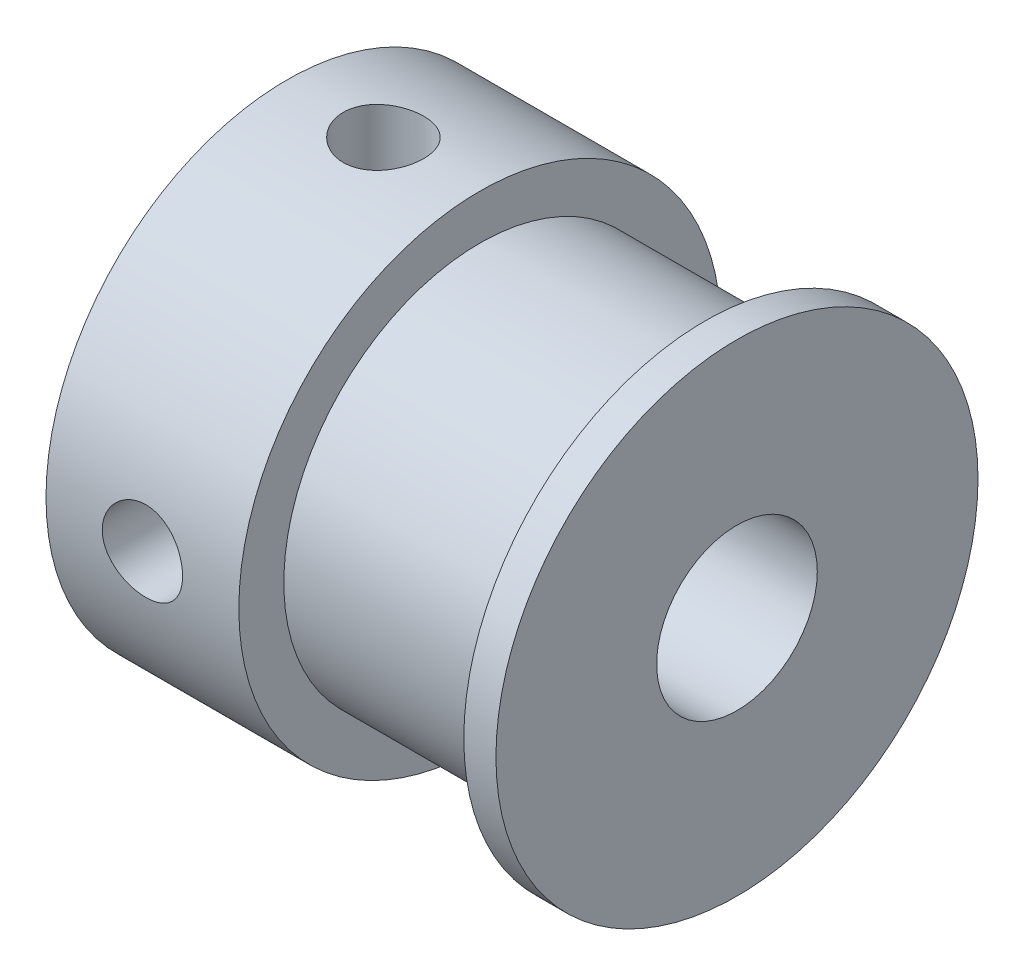
ISO-10303-21;
HEADER;
FILE_DESCRIPTION(('STEP AP214'),'2;1');
FILE_NAME('part.step','',(''),(''),'','','');
FILE_SCHEMA(('AUTOMOTIVE_DESIGN { 1 0 10303 214 1 1 1 1 }'));
ENDSEC;
DATA;
#1=APPLICATION_CONTEXT('core data for automotive mechanical design processes');
#2=APPLICATION_PROTOCOL_DEFINITION('international standard','automotive_design',2000,#1);
#3=PRODUCT_CONTEXT('',#1,'mechanical');
#4=PRODUCT('Part','Part','',(#3));
#5=PRODUCT_RELATED_PRODUCT_CATEGORY('part','',(#4));
#6=PRODUCT_DEFINITION_FORMATION('','',#4);
#7=PRODUCT_DEFINITION_CONTEXT('part definition',#1,'design');
#8=PRODUCT_DEFINITION('design','',#6,#7);
#9=PRODUCT_DEFINITION_SHAPE('','',#8);
#10=(LENGTH_UNIT() NAMED_UNIT(*) SI_UNIT(.MILLI.,.METRE.));
#11=(NAMED_UNIT(*) PLANE_ANGLE_UNIT() SI_UNIT($,.RADIAN.));
#12=(NAMED_UNIT(*) SI_UNIT($,.STERADIAN.) SOLID_ANGLE_UNIT());
#13=UNCERTAINTY_MEASURE_WITH_UNIT(LENGTH_MEASURE(1.E-05),#10,'distance_accuracy_value','');
#14=(GEOMETRIC_REPRESENTATION_CONTEXT(3) GLOBAL_UNCERTAINTY_ASSIGNED_CONTEXT((#13)) GLOBAL_UNIT_ASSIGNED_CONTEXT((#10,
#11,#12)) REPRESENTATION_CONTEXT('',''));
#15=CARTESIAN_POINT('',(0.,0.,0.));
#16=DIRECTION('',(0.,0.,1.));
#17=DIRECTION('',(1.,0.,0.));
#18=AXIS2_PLACEMENT_3D('',#15,#16,#17);
#19=CARTESIAN_POINT('',(0.,0.,0.));
#20=DIRECTION('',(1.,0.,0.));
#21=DIRECTION('',(0.,0.,-1.));
#22=AXIS2_PLACEMENT_3D('',#19,#20,#21);
#23=CYLINDRICAL_SURFACE('',#22,2.5);
#24=CARTESIAN_POINT('',(1.75000000000001,0.,2.5));
#25=CARTESIAN_POINT('',(1.75000412789938,0.0657149536912327,2.49999641755189));
#26=CARTESIAN_POINT('',(1.7552125914021,0.13150824962254,2.49738113774397));
#27=CARTESIAN_POINT('',(1.77581610042615,0.26115029408553,2.48717695046745));
#28=CARTESIAN_POINT('',(1.79123049124707,0.324995108391878,2.4795785978623));
#29=CARTESIAN_POINT('',(1.831492260771,0.448666931100716,2.4602034925414));
#30=CARTESIAN_POINT('',(1.85630298031002,0.508508503673972,2.448442989719));
#31=CARTESIAN_POINT('',(1.91446327670618,0.623090771008203,2.42182220644723));
#32=CARTESIAN_POINT('',(1.94781218031107,0.677831867487559,2.40696217041913));
#33=CARTESIAN_POINT('',(2.02439656185663,0.784384772202394,2.37445322822571));
#34=CARTESIAN_POINT('',(2.06810809904956,0.835819013902635,2.3566899890942));
#35=CARTESIAN_POINT('',(2.1631518490588,0.930974306083716,2.32074962808431));
#36=CARTESIAN_POINT('',(2.21448981471555,0.974689478883452,2.30257220261294));
#37=CARTESIAN_POINT('',(2.32810418690423,1.05656500056284,2.26623688996684));
#38=CARTESIAN_POINT('',(2.39092012293239,1.09403166943954,2.24818983712665));
#39=CARTESIAN_POINT('',(2.52295916998277,1.15771028361336,2.21607473465401));
#40=CARTESIAN_POINT('',(2.59217766090344,1.18393026870791,2.20200384508737));
#41=CARTESIAN_POINT('',(2.73083138177741,1.22266555273573,2.18072333797261));
#42=CARTESIAN_POINT('',(2.80000556508424,1.23590732135054,2.17315339479642));
#43=CARTESIAN_POINT('',(2.93997354722435,1.25053374163605,2.1647736243566));
#44=CARTESIAN_POINT('',(3.01076567608894,1.25193011046634,2.16395711679111));
#45=CARTESIAN_POINT('',(3.14285753039421,1.24335910896536,2.16888662821561));
#46=CARTESIAN_POINT('',(3.20428003902881,1.23473069942102,2.17385954577517));
#47=CARTESIAN_POINT('',(3.3246523867163,1.20867481132116,2.18845285917313));
#48=CARTESIAN_POINT('',(3.38360143163164,1.19124452987206,2.19807473539721));
#49=CARTESIAN_POINT('',(3.49903641570707,1.1477622254825,2.22109345515927));
#50=CARTESIAN_POINT('',(3.55543299848223,1.12151883389499,2.23457300829999));
#51=CARTESIAN_POINT('',(3.66329286573751,1.061302109585,2.26379255351755));
#52=CARTESIAN_POINT('',(3.71475391950011,1.02732530476558,2.27953355975239));
#53=CARTESIAN_POINT('',(3.81815156592903,0.94758256864098,2.31391447379108));
#54=CARTESIAN_POINT('',(3.86932109197019,0.900868072961596,2.33266887795933));
#55=CARTESIAN_POINT('',(3.96341927323862,0.799444473426712,2.36934529125509));
#56=CARTESIAN_POINT('',(4.00634399004235,0.744731570717852,2.38726689948501));
#57=CARTESIAN_POINT('',(4.08460707628715,0.625645632289807,2.42127484103705));
#58=CARTESIAN_POINT('',(4.11950059055717,0.560941989499257,2.43723730202509));
#59=CARTESIAN_POINT('',(4.17762128630375,0.425582769360993,2.46447351401553));
#60=CARTESIAN_POINT('',(4.20085773126895,0.354931970331593,2.47575098679441));
#61=CARTESIAN_POINT('',(4.23309425464584,0.215958114575875,2.49155417176795));
#62=CARTESIAN_POINT('',(4.24311404468347,0.147926913185404,2.4965617287664));
#63=CARTESIAN_POINT('',(4.2518309139181,0.0109744999366913,2.50091266823877));
#64=CARTESIAN_POINT('',(4.25053335704934,-0.057946274837377,2.5002587340164));
#65=CARTESIAN_POINT('',(4.23724163947655,-0.189041214982492,2.49363990316801));
#66=CARTESIAN_POINT('',(4.22608433408745,-0.251324260062442,2.48809057110237));
#67=CARTESIAN_POINT('',(4.19470241013114,-0.373008615377395,2.47277714143524));
#68=CARTESIAN_POINT('',(4.1744767919333,-0.432409607113745,2.46301257917916));
#69=CARTESIAN_POINT('',(4.12500191695853,-0.548610760562079,2.43980314267087));
#70=CARTESIAN_POINT('',(4.09551118735398,-0.605287996257689,2.42626102212424));
#71=CARTESIAN_POINT('',(4.02861558044244,-0.713076702123648,2.39679967896386));
#72=CARTESIAN_POINT('',(3.9912073317582,-0.764185787219099,2.38087944457232));
#73=CARTESIAN_POINT('',(3.9052994683339,-0.864709611613313,2.34635276671831));
#74=CARTESIAN_POINT('',(3.85607141443304,-0.913465097280795,2.32763606060552));
#75=CARTESIAN_POINT('',(3.75009356091336,-1.00232040139154,2.29077989504843));
#76=CARTESIAN_POINT('',(3.69333860147953,-1.04241423211355,2.27264084226908));
#77=CARTESIAN_POINT('',(3.57044543224961,-1.11463489312211,2.23813990282585));
#78=CARTESIAN_POINT('',(3.50398591723925,-1.14628186984829,2.2219066207934));
#79=CARTESIAN_POINT('',(3.36561241538434,-1.19760353251725,2.19467590460158));
#80=CARTESIAN_POINT('',(3.29370559187351,-1.21729364485946,2.18367172800773));
#81=CARTESIAN_POINT('',(3.15386222142319,-1.24232710931209,2.16951876260834));
#82=CARTESIAN_POINT('',(3.0862071832137,-1.24886624550107,2.16571729325614));
#83=CARTESIAN_POINT('',(2.95069116603659,-1.25086144297598,2.16456693307719));
#84=CARTESIAN_POINT('',(2.88283028907571,-1.24632230828049,2.16721524534441));
#85=CARTESIAN_POINT('',(2.75564562308498,-1.22740765699032,2.17797327562531));
#86=CARTESIAN_POINT('',(2.6961244123195,-1.21401039292849,2.18553868102992));
#87=CARTESIAN_POINT('',(2.58023985071912,-1.1789691977808,2.20463770234897));
#88=CARTESIAN_POINT('',(2.52387752238504,-1.15732261394975,2.21617259462095));
#89=CARTESIAN_POINT('',(2.41171893626674,-1.10476968162585,2.2428566295566));
#90=CARTESIAN_POINT('',(2.35621512271288,-1.07333892227057,2.25819652995239));
#91=CARTESIAN_POINT('',(2.25090682977427,-1.00268871454579,2.29044164543238));
#92=CARTESIAN_POINT('',(2.20110533685189,-0.963465214048303,2.30734767243153));
#93=CARTESIAN_POINT('',(2.10232252205298,-0.872754158330795,2.34327903949142));
#94=CARTESIAN_POINT('',(2.0541761220476,-0.820355528762707,2.36231229139336));
#95=CARTESIAN_POINT('',(1.96717127072046,-0.707693507775343,2.3984719031886));
#96=CARTESIAN_POINT('',(1.92831782571714,-0.647425904070975,2.4155972326005));
#97=CARTESIAN_POINT('',(1.86095454654725,-0.519914496024928,2.44622511981379));
#98=CARTESIAN_POINT('',(1.83251978823571,-0.452624379918263,2.45970120703636));
#99=CARTESIAN_POINT('',(1.78773979010132,-0.313427626617735,2.48126676704332));
#100=CARTESIAN_POINT('',(1.77136019146303,-0.241534749528953,2.48937154216165));
#101=CARTESIAN_POINT('',(1.7576282361552,-0.140752433104227,2.49619327387079));
#102=CARTESIAN_POINT('',(1.75477169892048,-0.112702349299371,2.49761706674002));
#103=CARTESIAN_POINT('',(1.750956668104,-0.0564396647589458,2.49952121222331));
#104=CARTESIAN_POINT('',(1.74999822691101,-0.0282270595592261,2.50000153879704));
#105=CARTESIAN_POINT('',(1.75000000000001,0.,2.5));
#106=B_SPLINE_CURVE_WITH_KNOTS('',3,(#24,#25,#26,#27,#28,#29,#30,#31,#32,#33,#34,#35,#36,#37,
#38,#39,#40,#41,#42,#43,#44,#45,#46,#47,#48,#49,#50,#51,#52,#53,#54,#55,#56,#57,#58,#59,#60,#61,
#62,#63,#64,#65,#66,#67,#68,#69,#70,#71,#72,#73,#74,#75,#76,#77,#78,#79,#80,#81,#82,#83,#84,#85,
#86,#87,#88,#89,#90,#91,#92,#93,#94,#95,#96,#97,#98,#99,#100,#101,#102,#103,#104,#105),
.UNSPECIFIED.,.T.,.F.,(4,2,2,2,2,2,2,2,2,2,2,2,2,2,2,2,2,2,2,2,2,2,2,2,2,2,2,2,2,2,2,2,2,2,2,2,
2,2,2,2,4),(0.,0.197030321775364,0.394435187136495,0.59107769436537,0.787704700726955,
0.996227198397605,1.20490779706754,1.4297715803844,1.6544743487285,1.86572515175286,
2.07676696661274,2.26257140511649,2.44843504907097,2.63862800210608,2.82890651575276,
3.04331176667346,3.25781918248356,3.48228777768049,3.70657771140347,3.9122911308918,
4.11790705639343,4.3075863313265,4.49728652038662,4.69241070034871,4.88761813435421,
5.10199513305521,5.31651985769287,5.54143352699589,5.76605639925969,5.96911634372963,
6.17208824825003,6.35572412805225,6.53941910979594,6.73545570969514,6.93159451423693,
7.15156553440619,7.37165479220712,7.59330017078652,7.81431135781158,7.89894100172117,
7.98357298143554),.UNSPECIFIED.);
#107=CARTESIAN_POINT('',(1.75000000000001,0.,2.5));
#108=VERTEX_POINT('',#107);
#109=EDGE_CURVE('E78',#108,#108,#106,.T.);
#110=ORIENTED_EDGE('',*,*,#109,.F.);
#111=EDGE_LOOP('',(#110));
#112=FACE_BOUND('',#111,.T.);
#113=CARTESIAN_POINT('',(3.,2.1650635094611,-1.25));
#114=CARTESIAN_POINT('',(3.06513476024406,2.16506918410574,-1.24999545384316));
#115=CARTESIAN_POINT('',(3.13035176440631,2.16804751484696,-1.24487496341652));
#116=CARTESIAN_POINT('',(3.25878408084644,2.17952958065066,-1.22465401237257));
#117=CARTESIAN_POINT('',(3.32199489380426,2.18804492569449,-1.20953258069272));
#118=CARTESIAN_POINT('',(3.44431458042993,2.20936683256748,-1.17012493587476));
#119=CARTESIAN_POINT('',(3.50344331559198,2.22215054341565,-1.14588744061716));
#120=CARTESIAN_POINT('',(3.6167802524959,2.25053331021072,-1.08908440672046));
#121=CARTESIAN_POINT('',(3.67098818782807,2.26613251845081,-1.05651841754472));
#122=CARTESIAN_POINT('',(3.77788216069688,2.29996086321802,-0.980833175663598));
#123=CARTESIAN_POINT('',(3.83007391959193,2.31830079547442,-0.937065045179713));
#124=CARTESIAN_POINT('',(3.92676048550839,2.35464978482132,-0.841567259518085));
#125=CARTESIAN_POINT('',(3.9712514532294,2.37265867289062,-0.789833657227866));
#126=CARTESIAN_POINT('',(4.05420893893458,2.40776846191186,-0.675611954268182));
#127=CARTESIAN_POINT('',(4.09206720982441,2.42472633022716,-0.612633986265718));
#128=CARTESIAN_POINT('',(4.1564260665572,2.45438445124411,-0.48019628324938));
#129=CARTESIAN_POINT('',(4.18293382017146,2.46708738979677,-0.410740672672694));
#130=CARTESIAN_POINT('',(4.22188082662637,2.48600576555297,-0.272556179907471));
#131=CARTESIAN_POINT('',(4.23518690794442,2.49261850276115,-0.204127238111022));
#132=CARTESIAN_POINT('',(4.2502076483438,2.50009479807584,-0.0657132858723104));
#133=CARTESIAN_POINT('',(4.25192932099464,2.50096183480737,0.00427075730467264));
#134=CARTESIAN_POINT('',(4.24406665753706,2.49703727395563,0.137290655529687));
#135=CARTESIAN_POINT('',(4.23545248059847,2.49273119865201,0.200401498970989));
#136=CARTESIAN_POINT('',(4.20889894511918,2.47967806574684,0.324142214897902));
#137=CARTESIAN_POINT('',(4.19095888877972,2.47093067582992,0.384771901367406));
#138=CARTESIAN_POINT('',(4.14614679238773,2.44964479109568,0.502886739461942));
#139=CARTESIAN_POINT('',(4.11915460853491,2.43705551911499,0.560316779393972));
#140=CARTESIAN_POINT('',(4.05717072974813,2.40922057483359,0.66997100189166));
#141=CARTESIAN_POINT('',(4.02217617087206,2.39397395196855,0.722193311048307));
#142=CARTESIAN_POINT('',(3.94138081058373,2.36055492999037,0.825217076122743));
#143=CARTESIAN_POINT('',(3.89487121459249,2.34224219997719,0.8754175937867));
#144=CARTESIAN_POINT('',(3.79426284383728,2.30567925733515,0.967630462872225));
#145=CARTESIAN_POINT('',(3.74015828465742,2.28742910332036,1.00963651446779));
#146=CARTESIAN_POINT('',(3.62168975946989,2.25180195115606,1.08688166830276));
#147=CARTESIAN_POINT('',(3.55689247118223,2.23455399988385,1.12152164372256));
#148=CARTESIAN_POINT('',(3.42132791080125,2.2046931284822,1.17914889125154));
#149=CARTESIAN_POINT('',(3.35056695872805,2.19207537557584,1.20214832276361));
#150=CARTESIAN_POINT('',(3.21098186089651,2.17430794771293,1.2339752637813));
#151=CARTESIAN_POINT('',(3.14244860119556,2.16864569810621,1.24378140264997));
#152=CARTESIAN_POINT('',(3.00449832310432,2.16397399202012,1.25189618326428));
#153=CARTESIAN_POINT('',(2.93508196360027,2.1649598361164,1.25021294664378));
#154=CARTESIAN_POINT('',(2.80543260177659,2.17292920675731,1.23629505417996));
#155=CARTESIAN_POINT('',(2.74502568611509,2.17924484383318,1.22523477089058));
#156=CARTESIAN_POINT('',(2.6270402671613,2.19617526939176,1.19462035579055));
#157=CARTESIAN_POINT('',(2.56946268656674,2.20679145006292,1.17506347327952));
#158=CARTESIAN_POINT('',(2.45573583637163,2.23170277599571,1.12705948575611));
#159=CARTESIAN_POINT('',(2.39977622893306,2.24614554053829,1.0982425796159));
#160=CARTESIAN_POINT('',(2.29316341057626,2.27695149371562,1.03285883001975));
#161=CARTESIAN_POINT('',(2.2425129456084,2.29331566693935,0.99628800541527));
#162=CARTESIAN_POINT('',(2.14127654059557,2.3285999807042,0.911046458998566));
#163=CARTESIAN_POINT('',(2.09150356160293,2.34758228942861,0.861431590393708));
#164=CARTESIAN_POINT('',(2.00073470250801,2.38417793722366,0.75425561924786));
#165=CARTESIAN_POINT('',(1.95974178721183,2.40179081259637,0.696691843319183));
#166=CARTESIAN_POINT('',(1.88678284256237,2.43426702113696,0.573169203198446));
#167=CARTESIAN_POINT('',(1.85508360223636,2.44904552090037,0.507028871967641));
#168=CARTESIAN_POINT('',(1.80357762017826,2.47354193699126,0.369402955801352));
#169=CARTESIAN_POINT('',(1.78376043579212,2.48326429595466,0.29792212674022));
#170=CARTESIAN_POINT('',(1.75828929478167,2.49584385227353,0.158724602913021));
#171=CARTESIAN_POINT('',(1.75150265515486,2.49924909885239,0.0912643048130715));
#172=CARTESIAN_POINT('',(1.748945918182,2.50052662968914,-0.0439074824390041));
#173=CARTESIAN_POINT('',(1.75317196434555,2.49840085083612,-0.111618875368858));
#174=CARTESIAN_POINT('',(1.77177050849453,2.48917461047403,-0.240672490396433));
#175=CARTESIAN_POINT('',(1.78545606157209,2.48241118334987,-0.302140397264079));
#176=CARTESIAN_POINT('',(1.82165874912871,2.46490117079279,-0.421807440229521));
#177=CARTESIAN_POINT('',(1.84417715011682,2.45415401415995,-0.480006106194385));
#178=CARTESIAN_POINT('',(1.89840881520747,2.4290741343515,-0.594279257806105));
#179=CARTESIAN_POINT('',(1.9304741540098,2.41460771498499,-0.650156428375057));
#180=CARTESIAN_POINT('',(2.00244741357381,2.38360166427283,-0.75596830226753));
#181=CARTESIAN_POINT('',(2.04235893639459,2.36706108197951,-0.805900259268633));
#182=CARTESIAN_POINT('',(2.13349642377838,2.33160762783285,-0.903642505196113));
#183=CARTESIAN_POINT('',(2.18545310934649,2.31262248764622,-0.950747105674089));
#184=CARTESIAN_POINT('',(2.29681340141221,2.27578845203566,-1.03582910924334));
#185=CARTESIAN_POINT('',(2.35622352608461,2.25794057202332,-1.07379843751257));
#186=CARTESIAN_POINT('',(2.48329580822619,2.22499506631145,-1.14053884973207));
#187=CARTESIAN_POINT('',(2.55115941391092,2.21000217820338,-1.16898133245117));
#188=CARTESIAN_POINT('',(2.69166550542472,2.1858269541044,-1.21359838688301));
#189=CARTESIAN_POINT('',(2.76429111114086,2.17662520184628,-1.22981398896918));
#190=CARTESIAN_POINT('',(2.864756694565,2.16911590752238,-1.24295875983052));
#191=CARTESIAN_POINT('',(2.89170986799735,2.1676016125644,-1.24559513120481));
#192=CARTESIAN_POINT('',(2.9457706008528,2.16557419859688,-1.24911675636245));
#193=CARTESIAN_POINT('',(2.97287817048234,2.16506114656387,-1.25000189299984));
#194=CARTESIAN_POINT('',(3.,2.1650635094611,-1.25));
#195=B_SPLINE_CURVE_WITH_KNOTS('',3,(#113,#114,#115,#116,#117,#118,#119,#120,#121,#122,#123,
#124,#125,#126,#127,#128,#129,#130,#131,#132,#133,#134,#135,#136,#137,#138,#139,#140,#141,#142,
#143,#144,#145,#146,#147,#148,#149,#150,#151,#152,#153,#154,#155,#156,#157,#158,#159,#160,#161,
#162,#163,#164,#165,#166,#167,#168,#169,#170,#171,#172,#173,#174,#175,#176,#177,#178,#179,#180,
#181,#182,#183,#184,#185,#186,#187,#188,#189,#190,#191,#192,#193,#194),.UNSPECIFIED.,.T.,.F.,(4,
2,2,2,2,2,2,2,2,2,2,2,2,2,2,2,2,2,2,2,2,2,2,2,2,2,2,2,2,2,2,2,2,2,2,2,2,2,2,2,4),(0.,
0.195290153243394,0.390991116031005,0.585660744898606,0.780340906806436,0.99107789062279,
1.20191963855464,1.42697365298454,1.65188533704864,1.86079356209919,2.0695752960755,
2.26020121855673,2.45084140646819,2.64411918413933,2.8374662418784,3.04908989321113,
3.26087560307398,3.4861105216181,3.71110967764631,3.91827863567764,4.12530116485466,
4.30967729280032,4.49411315545078,4.68709120507609,4.88016857775059,5.09758429475766,
5.31507331222752,5.53830226766207,5.76133474760964,5.96390337986858,6.16640108492464,
6.35555531089365,6.54473666890016,6.74200938399339,6.93937287625898,7.15637802312584,
7.37357428556442,7.59763436298256,7.8209391625345,7.90225168981636,7.98356965618175),.UNSPECIFIED.);
#196=CARTESIAN_POINT('',(3.,2.1650635094611,-1.25));
#197=VERTEX_POINT('',#196);
#198=EDGE_CURVE('E71',#197,#197,#195,.T.);
#199=ORIENTED_EDGE('',*,*,#198,.F.);
#200=EDGE_LOOP('',(#199));
#201=FACE_BOUND('',#200,.T.);
#202=CARTESIAN_POINT('',(14.,0.,0.));
#203=DIRECTION('',(1.,0.,0.));
#204=DIRECTION('',(0.,0.,-1.));
#205=AXIS2_PLACEMENT_3D('',#202,#203,#204);
#206=CIRCLE('',#205,2.5);
#207=CARTESIAN_POINT('',(14.,0.,-2.5));
#208=VERTEX_POINT('',#207);
#209=EDGE_CURVE('E77',#208,#208,#206,.T.);
#210=ORIENTED_EDGE('',*,*,#209,.T.);
#211=EDGE_LOOP('',(#210));
#212=FACE_BOUND('',#211,.T.);
#213=CARTESIAN_POINT('',(0.,0.,0.));
#214=DIRECTION('',(1.,0.,0.));
#215=DIRECTION('',(0.,0.,-1.));
#216=AXIS2_PLACEMENT_3D('',#213,#214,#215);
#217=CIRCLE('',#216,2.5);
#218=CARTESIAN_POINT('',(0.,0.,-2.5));
#219=VERTEX_POINT('',#218);
#220=EDGE_CURVE('E47',#219,#219,#217,.T.);
#221=ORIENTED_EDGE('',*,*,#220,.F.);
#222=EDGE_LOOP('',(#221));
#223=FACE_BOUND('',#222,.T.);
#224=ADVANCED_FACE('F32',(#112,#201,#212,#223),#23,.F.);
#225=CARTESIAN_POINT('',(0.,2.5,0.));
#226=DIRECTION('',(-1.,0.,0.));
#227=DIRECTION('',(0.,0.,1.));
#228=AXIS2_PLACEMENT_3D('',#225,#226,#227);
#229=PLANE('',#228);
#230=ORIENTED_EDGE('',*,*,#220,.T.);
#231=EDGE_LOOP('',(#230));
#232=FACE_BOUND('',#231,.T.);
#233=CARTESIAN_POINT('',(0.,0.,0.));
#234=DIRECTION('',(1.,0.,0.));
#235=DIRECTION('',(0.,0.,-1.));
#236=AXIS2_PLACEMENT_3D('',#233,#234,#235);
#237=CIRCLE('',#236,7.5);
#238=CARTESIAN_POINT('',(0.,0.,-7.5));
#239=VERTEX_POINT('',#238);
#240=EDGE_CURVE('E51',#239,#239,#237,.T.);
#241=ORIENTED_EDGE('',*,*,#240,.F.);
#242=EDGE_LOOP('',(#241));
#243=FACE_BOUND('',#242,.T.);
#244=ADVANCED_FACE('F102',(#232,#243),#229,.T.);
#245=CARTESIAN_POINT('',(0.,0.,0.));
#246=DIRECTION('',(1.,0.,0.));
#247=DIRECTION('',(0.,0.,-1.));
#248=AXIS2_PLACEMENT_3D('',#245,#246,#247);
#249=CYLINDRICAL_SURFACE('',#248,7.5);
#250=CARTESIAN_POINT('',(1.75000000000001,0.,7.5));
#251=CARTESIAN_POINT('',(1.75000279447392,-0.069695452479107,7.49999880584412));
#252=CARTESIAN_POINT('',(1.75584863748447,-0.13942894091941,7.49901838956517));
#253=CARTESIAN_POINT('',(1.77906782938267,-0.27694011083652,7.49520172470694));
#254=CARTESIAN_POINT('',(1.79645177845581,-0.344715933979622,7.49236376961945));
#255=CARTESIAN_POINT('',(1.84220772429638,-0.476302373606319,7.48515034118225));
#256=CARTESIAN_POINT('',(1.87057073282029,-0.540116184215947,7.48077612579597));
#257=CARTESIAN_POINT('',(1.9374561460262,-0.662070920988969,7.47097113541035));
#258=CARTESIAN_POINT('',(1.9759773887415,-0.720212494939292,7.46554048127217));
#259=CARTESIAN_POINT('',(2.06247754191024,-0.829736307145835,7.45416658729157));
#260=CARTESIAN_POINT('',(2.11053455731807,-0.881056451767479,7.44821935907428));
#261=CARTESIAN_POINT('',(2.21457398423641,-0.974944249329958,7.43651313438366));
#262=CARTESIAN_POINT('',(2.27055689572831,-1.01751134969548,7.43075414981334));
#263=CARTESIAN_POINT('',(2.38928548309853,-1.09293356280256,7.4200378287989));
#264=CARTESIAN_POINT('',(2.45207066840238,-1.12572727643049,7.41508564545818));
#265=CARTESIAN_POINT('',(2.58235478215032,-1.1802791827056,7.40659894897337));
#266=CARTESIAN_POINT('',(2.64985339183882,-1.2020381207828,7.40306434007154));
#267=CARTESIAN_POINT('',(2.78699013742827,-1.2337071888924,7.39785268421378));
#268=CARTESIAN_POINT('',(2.8566028682507,-1.24372451456769,7.3961588424285));
#269=CARTESIAN_POINT('',(2.99654013844174,-1.25195836264493,7.39476969468325));
#270=CARTESIAN_POINT('',(3.06686462708365,-1.25017572019449,7.39507424728607));
#271=CARTESIAN_POINT('',(3.20546393063772,-1.23494754919807,7.39763214431778));
#272=CARTESIAN_POINT('',(3.27375240177262,-1.22162244094488,7.39986536659458));
#273=CARTESIAN_POINT('',(3.40711065891456,-1.18387657020172,7.40599747605504));
#274=CARTESIAN_POINT('',(3.47218033444427,-1.15945542715986,7.40989642036636));
#275=CARTESIAN_POINT('',(3.59761441172046,-1.10008862304695,7.4189423966705));
#276=CARTESIAN_POINT('',(3.65795470304061,-1.06509295693985,7.42409533553663));
#277=CARTESIAN_POINT('',(3.77195220026919,-0.985606008778711,7.43506459207505));
#278=CARTESIAN_POINT('',(3.82560886622746,-0.941113960327138,7.44088096327143));
#279=CARTESIAN_POINT('',(3.92541304290367,-0.843241106079522,7.45261013939893));
#280=CARTESIAN_POINT('',(3.97145925927004,-0.789756981936559,7.45852324615826));
#281=CARTESIAN_POINT('',(4.05393888133267,-0.675767624490819,7.46971300698362));
#282=CARTESIAN_POINT('',(4.09037222509161,-0.615262345953207,7.47498965694873));
#283=CARTESIAN_POINT('',(4.15260111356814,-0.488852958083352,7.48431946446456));
#284=CARTESIAN_POINT('',(4.17838770966562,-0.422944362782327,7.48837159203724));
#285=CARTESIAN_POINT('',(4.21849710762298,-0.287649172801363,7.4947875150633));
#286=CARTESIAN_POINT('',(4.23282086848685,-0.218262869589732,7.49715145175237));
#287=CARTESIAN_POINT('',(4.24946067923056,-0.0788549506508106,7.49990564921343));
#288=CARTESIAN_POINT('',(4.2519157859028,-0.0088503685755048,7.50031876506392));
#289=CARTESIAN_POINT('',(4.24511932778593,0.130569886444944,7.49918737210585));
#290=CARTESIAN_POINT('',(4.23586821343312,0.199985581946019,7.49764293862059));
#291=CARTESIAN_POINT('',(4.20603757533225,0.33582808777338,7.49278413469101));
#292=CARTESIAN_POINT('',(4.18552689580493,0.402270434192688,7.48948052400655));
#293=CARTESIAN_POINT('',(4.13383274090023,0.530773442430219,7.48147232227679));
#294=CARTESIAN_POINT('',(4.10264866618236,0.592833857954856,7.4767676525601));
#295=CARTESIAN_POINT('',(4.0301744376516,0.711415344734475,7.46642258151204));
#296=CARTESIAN_POINT('',(3.98879742191637,0.76788262546857,7.46077427943511));
#297=CARTESIAN_POINT('',(3.89723134230746,0.873121792751339,7.4491923369595));
#298=CARTESIAN_POINT('',(3.84704163836166,0.921893119848286,7.44325867585773));
#299=CARTESIAN_POINT('',(3.73865122596428,1.01087138982899,7.43170087617923));
#300=CARTESIAN_POINT('',(3.68037291724279,1.05098438055685,7.42608058068553));
#301=CARTESIAN_POINT('',(3.55782351543073,1.12085115514749,7.41585764888942));
#302=CARTESIAN_POINT('',(3.49355261238625,1.1506052673849,7.4112549803301));
#303=CARTESIAN_POINT('',(3.36110513359393,1.19876916573657,7.40361726848852));
#304=CARTESIAN_POINT('',(3.29294595248475,1.21722571627397,7.40057577155532));
#305=CARTESIAN_POINT('',(3.15443993538912,1.24241772688913,7.3963885841763));
#306=CARTESIAN_POINT('',(3.08409329013397,1.24915420597308,7.39524272891361));
#307=CARTESIAN_POINT('',(2.9441474170188,1.25068643302367,7.39498366542006));
#308=CARTESIAN_POINT('',(2.87454981071236,1.24563006806259,7.39584528252825));
#309=CARTESIAN_POINT('',(2.73721037597462,1.22403991947842,7.39944890726864));
#310=CARTESIAN_POINT('',(2.66946854152907,1.20750617305623,7.40219090880607));
#311=CARTESIAN_POINT('',(2.5378207813537,1.16348724479744,7.40923678140859));
#312=CARTESIAN_POINT('',(2.47391049497199,1.13601479530021,7.41353883609835));
#313=CARTESIAN_POINT('',(2.35158216540258,1.07091350195795,7.42322184461104));
#314=CARTESIAN_POINT('',(2.29316439481394,1.03328415437427,7.428602851942));
#315=CARTESIAN_POINT('',(2.18273220844613,0.948409442186072,7.43991727022811));
#316=CARTESIAN_POINT('',(2.13080199164987,0.901055281796818,7.44585647788151));
#317=CARTESIAN_POINT('',(2.03557419776254,0.79830451569011,7.45757186180421));
#318=CARTESIAN_POINT('',(1.99227861568092,0.742906056456313,7.46334800013273));
#319=CARTESIAN_POINT('',(1.91527586590003,0.625184584820136,7.4741326482111));
#320=CARTESIAN_POINT('',(1.88163698034353,0.562816393766405,7.47913558126552));
#321=CARTESIAN_POINT('',(1.82536525769505,0.433256534689487,7.48775583800888));
#322=CARTESIAN_POINT('',(1.80272145946016,0.366069747415002,7.49137454088741));
#323=CARTESIAN_POINT('',(1.77399736293667,0.248851655022698,7.49602895416478));
#324=CARTESIAN_POINT('',(1.76501276519202,0.199529415149222,7.49751013636679));
#325=CARTESIAN_POINT('',(1.75301313107763,0.100144655159903,7.4994960799306));
#326=CARTESIAN_POINT('',(1.74999799193133,0.0500821478042465,7.50000085810321));
#327=CARTESIAN_POINT('',(1.75000000000001,0.,7.5));
#328=B_SPLINE_CURVE_WITH_KNOTS('',3,(#250,#251,#252,#253,#254,#255,#256,#257,#258,#259,#260,
#261,#262,#263,#264,#265,#266,#267,#268,#269,#270,#271,#272,#273,#274,#275,#276,#277,#278,#279,
#280,#281,#282,#283,#284,#285,#286,#287,#288,#289,#290,#291,#292,#293,#294,#295,#296,#297,#298,
#299,#300,#301,#302,#303,#304,#305,#306,#307,#308,#309,#310,#311,#312,#313,#314,#315,#316,#317,
#318,#319,#320,#321,#322,#323,#324,#325,#326,#327),.UNSPECIFIED.,.T.,.F.,(4,2,2,2,2,2,2,2,2,2,2,
2,2,2,2,2,2,2,2,2,2,2,2,2,2,2,2,2,2,2,2,2,2,2,2,2,2,2,4),(0.,0.208903292469254,
0.417998772847708,0.626923433512632,0.835824206337391,1.04651245531165,1.25721400084928,
1.46921260411919,1.6811968843809,1.89123038551711,2.10124902160442,2.30910260880203,
2.51696332512689,2.72582278316277,2.93469910340285,3.14616384955662,3.35762995817922,
3.5692734445795,3.78089922260572,3.99003941745696,4.19917156517927,4.40703903503205,
4.61491817913031,4.82463412813509,5.03436531527139,5.24626911003807,5.45816618687968,
5.66918011170883,5.88017568893306,6.08853954761347,6.29690273094063,6.50502409113108,
6.71315577514664,6.92375692096692,7.13440666939482,7.34651115803596,7.55840376065032,
7.70852124082005,7.85863613638479),.UNSPECIFIED.);
#329=CARTESIAN_POINT('',(1.75000000000001,0.,7.5));
#330=VERTEX_POINT('',#329);
#331=EDGE_CURVE('E10',#330,#330,#328,.T.);
#332=ORIENTED_EDGE('',*,*,#331,.F.);
#333=EDGE_LOOP('',(#332));
#334=FACE_BOUND('',#333,.T.);
#335=CARTESIAN_POINT('',(4.25,7.5,0.));
#336=CARTESIAN_POINT('',(4.24999720552609,7.49999880584412,-0.0696954524791073));
#337=CARTESIAN_POINT('',(4.24415136251554,7.49901838956517,-0.13942894091941));
#338=CARTESIAN_POINT('',(4.22093217061734,7.49520172470694,-0.276940110836521));
#339=CARTESIAN_POINT('',(4.2035482215442,7.49236376961945,-0.344715933979623));
#340=CARTESIAN_POINT('',(4.15779227570362,7.48515034118225,-0.476302373606321));
#341=CARTESIAN_POINT('',(4.12942926717971,7.48077612579596,-0.54011618421595));
#342=CARTESIAN_POINT('',(4.0625438539738,7.47097113541035,-0.662070920988972));
#343=CARTESIAN_POINT('',(4.0240226112585,7.46554048127217,-0.720212494939295));
#344=CARTESIAN_POINT('',(3.93752245808977,7.45416658729156,-0.829736307145839));
#345=CARTESIAN_POINT('',(3.88946544268193,7.44821935907428,-0.881056451767483));
#346=CARTESIAN_POINT('',(3.78542601576359,7.43651313438366,-0.974944249329963));
#347=CARTESIAN_POINT('',(3.72944310427169,7.43075414981334,-1.01751134969548));
#348=CARTESIAN_POINT('',(3.61071451690147,7.4200378287989,-1.09293356280257));
#349=CARTESIAN_POINT('',(3.54792933159762,7.41508564545818,-1.1257272764305));
#350=CARTESIAN_POINT('',(3.41764521784969,7.40659894897337,-1.18027918270561));
#351=CARTESIAN_POINT('',(3.35014660816118,7.40306434007154,-1.20203812078281));
#352=CARTESIAN_POINT('',(3.21300986257173,7.39785268421378,-1.2337071888924));
#353=CARTESIAN_POINT('',(3.1433971317493,7.3961588424285,-1.2437245145677));
#354=CARTESIAN_POINT('',(3.00345986155826,7.39476969468325,-1.25195836264494));
#355=CARTESIAN_POINT('',(2.93313537291635,7.39507424728607,-1.2501757201945));
#356=CARTESIAN_POINT('',(2.79453606936228,7.39763214431777,-1.23494754919808));
#357=CARTESIAN_POINT('',(2.72624759822738,7.39986536659458,-1.22162244094489));
#358=CARTESIAN_POINT('',(2.59288934108543,7.40599747605504,-1.18387657020172));
#359=CARTESIAN_POINT('',(2.52781966555573,7.40989642036636,-1.15945542715987));
#360=CARTESIAN_POINT('',(2.40238558827954,7.4189423966705,-1.10008862304696));
#361=CARTESIAN_POINT('',(2.34204529695939,7.42409533553663,-1.06509295693986));
#362=CARTESIAN_POINT('',(2.22804779973081,7.43506459207504,-0.985606008778716));
#363=CARTESIAN_POINT('',(2.17439113377253,7.44088096327143,-0.941113960327143));
#364=CARTESIAN_POINT('',(2.07458695709633,7.45261013939893,-0.843241106079526));
#365=CARTESIAN_POINT('',(2.02854074072996,7.45852324615826,-0.789756981936563));
#366=CARTESIAN_POINT('',(1.94606111866733,7.46971300698362,-0.675767624490822));
#367=CARTESIAN_POINT('',(1.90962777490839,7.47498965694873,-0.61526234595321));
#368=CARTESIAN_POINT('',(1.84739888643186,7.48431946446456,-0.488852958083355));
#369=CARTESIAN_POINT('',(1.82161229033437,7.48837159203724,-0.42294436278233));
#370=CARTESIAN_POINT('',(1.78150289237701,7.4947875150633,-0.287649172801365));
#371=CARTESIAN_POINT('',(1.76717913151314,7.49715145175237,-0.218262869589734));
#372=CARTESIAN_POINT('',(1.75053932076943,7.49990564921343,-0.0788549506508116));
#373=CARTESIAN_POINT('',(1.7480842140972,7.50031876506392,-0.00885036857550548));
#374=CARTESIAN_POINT('',(1.75488067221406,7.49918737210585,0.130569886444944));
#375=CARTESIAN_POINT('',(1.76413178656687,7.49764293862059,0.199985581946019));
#376=CARTESIAN_POINT('',(1.79396242466774,7.49278413469101,0.335828087773382));
#377=CARTESIAN_POINT('',(1.81447310419506,7.48948052400655,0.402270434192689));
#378=CARTESIAN_POINT('',(1.86616725909977,7.48147232227679,0.530773442430221));
#379=CARTESIAN_POINT('',(1.89735133381764,7.4767676525601,0.592833857954859));
#380=CARTESIAN_POINT('',(1.96982556234839,7.46642258151204,0.711415344734479));
#381=CARTESIAN_POINT('',(2.01120257808363,7.46077427943511,0.767882625468573));
#382=CARTESIAN_POINT('',(2.10276865769253,7.4491923369595,0.873121792751343));
#383=CARTESIAN_POINT('',(2.15295836163834,7.44325867585773,0.921893119848291));
#384=CARTESIAN_POINT('',(2.26134877403571,7.43170087617923,1.010871389829));
#385=CARTESIAN_POINT('',(2.31962708275721,7.42608058068553,1.05098438055686));
#386=CARTESIAN_POINT('',(2.44217648456927,7.41585764888942,1.12085115514749));
#387=CARTESIAN_POINT('',(2.50644738761375,7.4112549803301,1.15060526738491));
#388=CARTESIAN_POINT('',(2.63889486640607,7.40361726848852,1.19876916573657));
#389=CARTESIAN_POINT('',(2.70705404751524,7.40057577155532,1.21722571627397));
#390=CARTESIAN_POINT('',(2.84556006461088,7.3963885841763,1.24241772688914));
#391=CARTESIAN_POINT('',(2.91590670986603,7.39524272891361,1.24915420597308));
#392=CARTESIAN_POINT('',(3.0558525829812,7.39498366542006,1.25068643302368));
#393=CARTESIAN_POINT('',(3.12545018928764,7.39584528252825,1.24563006806259));
#394=CARTESIAN_POINT('',(3.26278962402538,7.39944890726864,1.22403991947842));
#395=CARTESIAN_POINT('',(3.33053145847094,7.40219090880607,1.20750617305624));
#396=CARTESIAN_POINT('',(3.46217921864631,7.40923678140859,1.16348724479745));
#397=CARTESIAN_POINT('',(3.52608950502801,7.41353883609835,1.13601479530022));
#398=CARTESIAN_POINT('',(3.64841783459742,7.42322184461104,1.07091350195795));
#399=CARTESIAN_POINT('',(3.70683560518607,7.428602851942,1.03328415437428));
#400=CARTESIAN_POINT('',(3.81726779155388,7.43991727022811,0.948409442186077));
#401=CARTESIAN_POINT('',(3.86919800835014,7.44585647788151,0.901055281796823));
#402=CARTESIAN_POINT('',(3.96442580223747,7.4575718618042,0.798304515690114));
#403=CARTESIAN_POINT('',(4.00772138431909,7.46334800013273,0.742906056456317));
#404=CARTESIAN_POINT('',(4.08472413409997,7.4741326482111,0.62518458482014));
#405=CARTESIAN_POINT('',(4.11836301965648,7.47913558126552,0.562816393766409));
#406=CARTESIAN_POINT('',(4.17463474230496,7.48775583800888,0.43325653468949));
#407=CARTESIAN_POINT('',(4.19727854053985,7.49137454088741,0.366069747415004));
#408=CARTESIAN_POINT('',(4.22600263706333,7.49602895416478,0.2488516550227));
#409=CARTESIAN_POINT('',(4.23498723480798,7.49751013636679,0.199529415149223));
#410=CARTESIAN_POINT('',(4.24698686892238,7.4994960799306,0.100144655159904));
#411=CARTESIAN_POINT('',(4.25000200806868,7.50000085810321,0.050082147804247));
#412=CARTESIAN_POINT('',(4.25,7.5,0.));
#413=B_SPLINE_CURVE_WITH_KNOTS('',3,(#335,#336,#337,#338,#339,#340,#341,#342,#343,#344,#345,
#346,#347,#348,#349,#350,#351,#352,#353,#354,#355,#356,#357,#358,#359,#360,#361,#362,#363,#364,
#365,#366,#367,#368,#369,#370,#371,#372,#373,#374,#375,#376,#377,#378,#379,#380,#381,#382,#383,
#384,#385,#386,#387,#388,#389,#390,#391,#392,#393,#394,#395,#396,#397,#398,#399,#400,#401,#402,
#403,#404,#405,#406,#407,#408,#409,#410,#411,#412),.UNSPECIFIED.,.T.,.F.,(4,2,2,2,2,2,2,2,2,2,2,
2,2,2,2,2,2,2,2,2,2,2,2,2,2,2,2,2,2,2,2,2,2,2,2,2,2,2,4),(0.,0.208903292469254,0.41799877284771,
0.626923433512634,0.835824206337395,1.04651245531166,1.25721400084928,1.4692126041192,
1.6811968843809,1.89123038551712,2.10124902160443,2.30910260880204,2.5169633251269,
2.72582278316278,2.93469910340286,3.14616384955663,3.35762995817923,3.56927344457951,
3.78089922260574,3.99003941745698,4.19917156517929,4.40703903503207,4.61491817913033,
4.82463412813511,5.03436531527141,5.24626911003809,5.45816618687971,5.66918011170886,
5.88017568893308,6.0885395476135,6.29690273094066,6.50502409113111,6.71315577514667,
6.92375692096695,7.13440666939486,7.34651115803599,7.55840376065035,7.70852124082008,
7.85863613638483),.UNSPECIFIED.);
#414=CARTESIAN_POINT('',(4.25,7.5,0.));
#415=VERTEX_POINT('',#414);
#416=EDGE_CURVE('E43',#415,#415,#413,.T.);
#417=ORIENTED_EDGE('',*,*,#416,.F.);
#418=EDGE_LOOP('',(#417));
#419=FACE_BOUND('',#418,.T.);
#420=ORIENTED_EDGE('',*,*,#240,.T.);
#421=EDGE_LOOP('',(#420));
#422=FACE_BOUND('',#421,.T.);
#423=CARTESIAN_POINT('',(6.,0.,0.));
#424=DIRECTION('',(1.,0.,0.));
#425=DIRECTION('',(0.,0.,-1.));
#426=AXIS2_PLACEMENT_3D('',#423,#424,#425);
#427=CIRCLE('',#426,7.5);
#428=CARTESIAN_POINT('',(6.,0.,-7.5));
#429=VERTEX_POINT('',#428);
#430=EDGE_CURVE('E95',#429,#429,#427,.T.);
#431=ORIENTED_EDGE('',*,*,#430,.F.);
#432=EDGE_LOOP('',(#431));
#433=FACE_BOUND('',#432,.T.);
#434=ADVANCED_FACE('F57',(#334,#419,#422,#433),#249,.T.);
#435=CARTESIAN_POINT('',(6.,7.5,0.));
#436=DIRECTION('',(1.,0.,0.));
#437=DIRECTION('',(0.,0.,-1.));
#438=AXIS2_PLACEMENT_3D('',#435,#436,#437);
#439=PLANE('',#438);
#440=ORIENTED_EDGE('',*,*,#430,.T.);
#441=EDGE_LOOP('',(#440));
#442=FACE_BOUND('',#441,.T.);
#443=CARTESIAN_POINT('',(6.,0.,0.));
#444=DIRECTION('',(1.,0.,0.));
#445=DIRECTION('',(0.,0.,-1.));
#446=AXIS2_PLACEMENT_3D('',#443,#444,#445);
#447=CIRCLE('',#446,6.1);
#448=CARTESIAN_POINT('',(6.,0.,-6.1));
#449=VERTEX_POINT('',#448);
#450=EDGE_CURVE('E92',#449,#449,#447,.T.);
#451=ORIENTED_EDGE('',*,*,#450,.F.);
#452=EDGE_LOOP('',(#451));
#453=FACE_BOUND('',#452,.T.);
#454=ADVANCED_FACE('F109',(#442,#453),#439,.T.);
#455=CARTESIAN_POINT('',(0.,0.,0.));
#456=DIRECTION('',(1.,0.,0.));
#457=DIRECTION('',(0.,0.,-1.));
#458=AXIS2_PLACEMENT_3D('',#455,#456,#457);
#459=CYLINDRICAL_SURFACE('',#458,6.1);
#460=ORIENTED_EDGE('',*,*,#450,.T.);
#461=EDGE_LOOP('',(#460));
#462=FACE_BOUND('',#461,.T.);
#463=CARTESIAN_POINT('',(13.,0.,0.));
#464=DIRECTION('',(1.,0.,0.));
#465=DIRECTION('',(0.,0.,-1.));
#466=AXIS2_PLACEMENT_3D('',#463,#464,#465);
#467=CIRCLE('',#466,6.1);
#468=CARTESIAN_POINT('',(13.,0.,-6.1));
#469=VERTEX_POINT('',#468);
#470=EDGE_CURVE('E89',#469,#469,#467,.T.);
#471=ORIENTED_EDGE('',*,*,#470,.F.);
#472=EDGE_LOOP('',(#471));
#473=FACE_BOUND('',#472,.T.);
#474=ADVANCED_FACE('F136',(#462,#473),#459,.T.);
#475=CARTESIAN_POINT('',(13.,6.1,0.));
#476=DIRECTION('',(-1.,0.,0.));
#477=DIRECTION('',(0.,0.,1.));
#478=AXIS2_PLACEMENT_3D('',#475,#476,#477);
#479=PLANE('',#478);
#480=ORIENTED_EDGE('',*,*,#470,.T.);
#481=EDGE_LOOP('',(#480));
#482=FACE_BOUND('',#481,.T.);
#483=CARTESIAN_POINT('',(13.,0.,0.));
#484=DIRECTION('',(1.,0.,0.));
#485=DIRECTION('',(0.,0.,-1.));
#486=AXIS2_PLACEMENT_3D('',#483,#484,#485);
#487=CIRCLE('',#486,7.5);
#488=CARTESIAN_POINT('',(13.,0.,-7.5));
#489=VERTEX_POINT('',#488);
#490=EDGE_CURVE('E86',#489,#489,#487,.T.);
#491=ORIENTED_EDGE('',*,*,#490,.F.);
#492=EDGE_LOOP('',(#491));
#493=FACE_BOUND('',#492,.T.);
#494=ADVANCED_FACE('F129',(#482,#493),#479,.T.);
#495=CARTESIAN_POINT('',(0.,0.,0.));
#496=DIRECTION('',(1.,0.,0.));
#497=DIRECTION('',(0.,0.,-1.));
#498=AXIS2_PLACEMENT_3D('',#495,#496,#497);
#499=CYLINDRICAL_SURFACE('',#498,7.5);
#500=ORIENTED_EDGE('',*,*,#490,.T.);
#501=EDGE_LOOP('',(#500));
#502=FACE_BOUND('',#501,.T.);
#503=CARTESIAN_POINT('',(14.,0.,0.));
#504=DIRECTION('',(1.,0.,0.));
#505=DIRECTION('',(0.,0.,-1.));
#506=AXIS2_PLACEMENT_3D('',#503,#504,#505);
#507=CIRCLE('',#506,7.5);
#508=CARTESIAN_POINT('',(14.,0.,-7.5));
#509=VERTEX_POINT('',#508);
#510=EDGE_CURVE('E83',#509,#509,#507,.T.);
#511=ORIENTED_EDGE('',*,*,#510,.F.);
#512=EDGE_LOOP('',(#511));
#513=FACE_BOUND('',#512,.T.);
#514=ADVANCED_FACE('F124',(#502,#513),#499,.T.);
#515=CARTESIAN_POINT('',(14.,7.5,0.));
#516=DIRECTION('',(1.,0.,0.));
#517=DIRECTION('',(0.,0.,-1.));
#518=AXIS2_PLACEMENT_3D('',#515,#516,#517);
#519=PLANE('',#518);
#520=ORIENTED_EDGE('',*,*,#510,.T.);
#521=EDGE_LOOP('',(#520));
#522=FACE_BOUND('',#521,.T.);
#523=ORIENTED_EDGE('',*,*,#209,.F.);
#524=EDGE_LOOP('',(#523));
#525=FACE_BOUND('',#524,.T.);
#526=ADVANCED_FACE('F65',(#522,#525),#519,.T.);
#527=CARTESIAN_POINT('',(3.,0.,0.));
#528=DIRECTION('',(0.,-1.,0.));
#529=DIRECTION('',(0.,0.,-1.));
#530=AXIS2_PLACEMENT_3D('',#527,#528,#529);
#531=CYLINDRICAL_SURFACE('',#530,1.25);
#532=ORIENTED_EDGE('',*,*,#198,.T.);
#533=EDGE_LOOP('',(#532));
#534=FACE_BOUND('',#533,.T.);
#535=ORIENTED_EDGE('',*,*,#416,.T.);
#536=EDGE_LOOP('',(#535));
#537=FACE_BOUND('',#536,.T.);
#538=ADVANCED_FACE('F60',(#534,#537),#531,.F.);
#539=CARTESIAN_POINT('',(3.,0.,0.));
#540=DIRECTION('',(0.,0.,-1.));
#541=DIRECTION('',(-1.,0.,0.));
#542=AXIS2_PLACEMENT_3D('',#539,#540,#541);
#543=CYLINDRICAL_SURFACE('',#542,1.24999999999999);
#544=ORIENTED_EDGE('',*,*,#109,.T.);
#545=EDGE_LOOP('',(#544));
#546=FACE_BOUND('',#545,.T.);
#547=ORIENTED_EDGE('',*,*,#331,.T.);
#548=EDGE_LOOP('',(#547));
#549=FACE_BOUND('',#548,.T.);
#550=ADVANCED_FACE('F64',(#546,#549),#543,.F.);
#551=CLOSED_SHELL('',(#224,#244,#434,#454,#474,#494,#514,#526,#538,#550));
#552=MANIFOLD_SOLID_BREP('B2',#551);
#553=ADVANCED_BREP_SHAPE_REPRESENTATION('',(#18,#552),#14);
#554=SHAPE_DEFINITION_REPRESENTATION(#9,#553);
ENDSEC;
END-ISO-10303-21;
